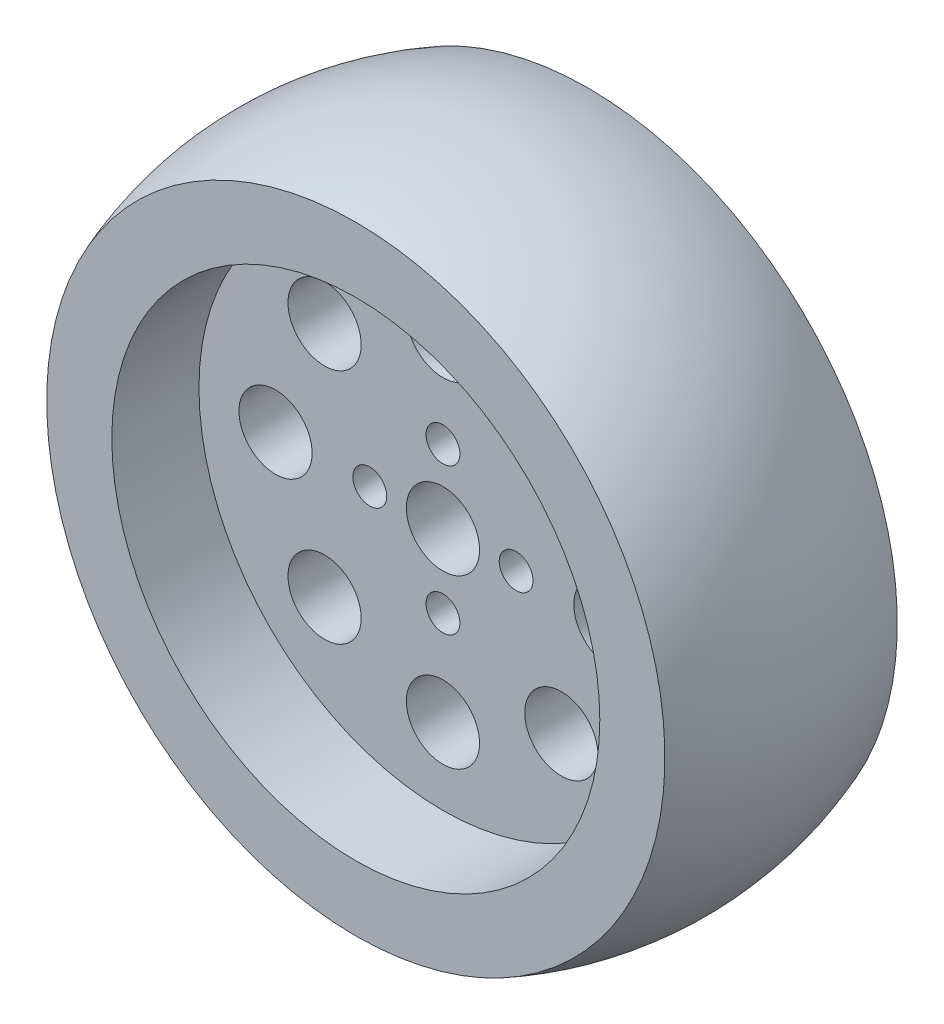
ISO-10303-21;
HEADER;
FILE_DESCRIPTION(('STEP AP214'),'2;1');
FILE_NAME('part.step','',(''),(''),'','','');
FILE_SCHEMA(('AUTOMOTIVE_DESIGN { 1 0 10303 214 1 1 1 1 }'));
ENDSEC;
DATA;
#1=APPLICATION_CONTEXT('core data for automotive mechanical design processes');
#2=APPLICATION_PROTOCOL_DEFINITION('international standard','automotive_design',2000,#1);
#3=PRODUCT_CONTEXT('',#1,'mechanical');
#4=PRODUCT('Part','Part','',(#3));
#5=PRODUCT_RELATED_PRODUCT_CATEGORY('part','',(#4));
#6=PRODUCT_DEFINITION_FORMATION('','',#4);
#7=PRODUCT_DEFINITION_CONTEXT('part definition',#1,'design');
#8=PRODUCT_DEFINITION('design','',#6,#7);
#9=PRODUCT_DEFINITION_SHAPE('','',#8);
#10=(LENGTH_UNIT() NAMED_UNIT(*) SI_UNIT(.MILLI.,.METRE.));
#11=(NAMED_UNIT(*) PLANE_ANGLE_UNIT() SI_UNIT($,.RADIAN.));
#12=(NAMED_UNIT(*) SI_UNIT($,.STERADIAN.) SOLID_ANGLE_UNIT());
#13=UNCERTAINTY_MEASURE_WITH_UNIT(LENGTH_MEASURE(1.E-05),#10,'distance_accuracy_value','');
#14=(GEOMETRIC_REPRESENTATION_CONTEXT(3) GLOBAL_UNCERTAINTY_ASSIGNED_CONTEXT((#13)) GLOBAL_UNIT_ASSIGNED_CONTEXT((#10,
#11,#12)) REPRESENTATION_CONTEXT('',''));
#15=CARTESIAN_POINT('',(0.,0.,0.));
#16=DIRECTION('',(0.,0.,1.));
#17=DIRECTION('',(1.,0.,0.));
#18=AXIS2_PLACEMENT_3D('',#15,#16,#17);
#19=CARTESIAN_POINT('',(0.,0.,-3.175));
#20=DIRECTION('',(0.,0.,1.));
#21=DIRECTION('',(0.,-1.,0.));
#22=AXIS2_PLACEMENT_3D('',#19,#20,#21);
#23=CYLINDRICAL_SURFACE('',#22,4.);
#24=CARTESIAN_POINT('',(0.,0.,3.175));
#25=DIRECTION('',(0.,0.,1.));
#26=DIRECTION('',(0.,-1.,0.));
#27=AXIS2_PLACEMENT_3D('',#24,#25,#26);
#28=CIRCLE('',#27,4.);
#29=CARTESIAN_POINT('',(0.,-4.,3.175));
#30=VERTEX_POINT('',#29);
#31=EDGE_CURVE('E77',#30,#30,#28,.F.);
#32=ORIENTED_EDGE('',*,*,#31,.F.);
#33=EDGE_LOOP('',(#32));
#34=FACE_BOUND('',#33,.T.);
#35=CARTESIAN_POINT('',(0.,0.,-3.175));
#36=DIRECTION('',(0.,0.,1.));
#37=DIRECTION('',(0.,-1.,0.));
#38=AXIS2_PLACEMENT_3D('',#35,#36,#37);
#39=CIRCLE('',#38,4.);
#40=CARTESIAN_POINT('',(0.,-4.,-3.175));
#41=VERTEX_POINT('',#40);
#42=EDGE_CURVE('E16',#41,#41,#39,.F.);
#43=ORIENTED_EDGE('',*,*,#42,.T.);
#44=EDGE_LOOP('',(#43));
#45=FACE_BOUND('',#44,.T.);
#46=ADVANCED_FACE('F13',(#34,#45),#23,.F.);
#47=CARTESIAN_POINT('',(8.,0.,-15.24));
#48=DIRECTION('',(0.,0.,1.));
#49=DIRECTION('',(1.,0.,0.));
#50=AXIS2_PLACEMENT_3D('',#47,#48,#49);
#51=CYLINDRICAL_SURFACE('',#50,1.85);
#52=CARTESIAN_POINT('',(8.,0.,3.175));
#53=DIRECTION('',(0.,0.,1.));
#54=DIRECTION('',(1.,0.,0.));
#55=AXIS2_PLACEMENT_3D('',#52,#53,#54);
#56=CIRCLE('',#55,1.85);
#57=CARTESIAN_POINT('',(9.85,0.,3.175));
#58=VERTEX_POINT('',#57);
#59=EDGE_CURVE('E74',#58,#58,#56,.F.);
#60=ORIENTED_EDGE('',*,*,#59,.F.);
#61=EDGE_LOOP('',(#60));
#62=FACE_BOUND('',#61,.T.);
#63=CARTESIAN_POINT('',(8.,0.,-3.175));
#64=DIRECTION('',(0.,0.,1.));
#65=DIRECTION('',(1.,0.,0.));
#66=AXIS2_PLACEMENT_3D('',#63,#64,#65);
#67=CIRCLE('',#66,1.85);
#68=CARTESIAN_POINT('',(9.85,0.,-3.175));
#69=VERTEX_POINT('',#68);
#70=EDGE_CURVE('E112',#69,#69,#67,.F.);
#71=ORIENTED_EDGE('',*,*,#70,.T.);
#72=EDGE_LOOP('',(#71));
#73=FACE_BOUND('',#72,.T.);
#74=ADVANCED_FACE('F335',(#62,#73),#51,.F.);
#75=CARTESIAN_POINT('',(0.,-8.,-15.24));
#76=DIRECTION('',(0.,0.,1.));
#77=DIRECTION('',(1.,0.,0.));
#78=AXIS2_PLACEMENT_3D('',#75,#76,#77);
#79=CYLINDRICAL_SURFACE('',#78,1.85);
#80=CARTESIAN_POINT('',(0.,-8.,3.175));
#81=DIRECTION('',(0.,0.,1.));
#82=DIRECTION('',(1.,0.,0.));
#83=AXIS2_PLACEMENT_3D('',#80,#81,#82);
#84=CIRCLE('',#83,1.85);
#85=CARTESIAN_POINT('',(1.85,-8.,3.175));
#86=VERTEX_POINT('',#85);
#87=EDGE_CURVE('E71',#86,#86,#84,.F.);
#88=ORIENTED_EDGE('',*,*,#87,.F.);
#89=EDGE_LOOP('',(#88));
#90=FACE_BOUND('',#89,.T.);
#91=CARTESIAN_POINT('',(0.,-8.,-3.175));
#92=DIRECTION('',(0.,0.,1.));
#93=DIRECTION('',(1.,0.,0.));
#94=AXIS2_PLACEMENT_3D('',#91,#92,#93);
#95=CIRCLE('',#94,1.85);
#96=CARTESIAN_POINT('',(1.85,-8.,-3.175));
#97=VERTEX_POINT('',#96);
#98=EDGE_CURVE('E110',#97,#97,#95,.F.);
#99=ORIENTED_EDGE('',*,*,#98,.T.);
#100=EDGE_LOOP('',(#99));
#101=FACE_BOUND('',#100,.T.);
#102=ADVANCED_FACE('F324',(#90,#101),#79,.F.);
#103=CARTESIAN_POINT('',(-8.,0.,-15.24));
#104=DIRECTION('',(0.,0.,1.));
#105=DIRECTION('',(1.,0.,0.));
#106=AXIS2_PLACEMENT_3D('',#103,#104,#105);
#107=CYLINDRICAL_SURFACE('',#106,1.85);
#108=CARTESIAN_POINT('',(-8.,0.,3.175));
#109=DIRECTION('',(0.,0.,1.));
#110=DIRECTION('',(1.,0.,0.));
#111=AXIS2_PLACEMENT_3D('',#108,#109,#110);
#112=CIRCLE('',#111,1.85);
#113=CARTESIAN_POINT('',(-6.15,0.,3.175));
#114=VERTEX_POINT('',#113);
#115=EDGE_CURVE('E68',#114,#114,#112,.F.);
#116=ORIENTED_EDGE('',*,*,#115,.F.);
#117=EDGE_LOOP('',(#116));
#118=FACE_BOUND('',#117,.T.);
#119=CARTESIAN_POINT('',(-8.,0.,-3.175));
#120=DIRECTION('',(0.,0.,1.));
#121=DIRECTION('',(1.,0.,0.));
#122=AXIS2_PLACEMENT_3D('',#119,#120,#121);
#123=CIRCLE('',#122,1.85);
#124=CARTESIAN_POINT('',(-6.15,0.,-3.175));
#125=VERTEX_POINT('',#124);
#126=EDGE_CURVE('E107',#125,#125,#123,.F.);
#127=ORIENTED_EDGE('',*,*,#126,.T.);
#128=EDGE_LOOP('',(#127));
#129=FACE_BOUND('',#128,.T.);
#130=ADVANCED_FACE('F313',(#118,#129),#107,.F.);
#131=CARTESIAN_POINT('',(0.,8.,-15.24));
#132=DIRECTION('',(0.,0.,1.));
#133=DIRECTION('',(1.,0.,0.));
#134=AXIS2_PLACEMENT_3D('',#131,#132,#133);
#135=CYLINDRICAL_SURFACE('',#134,1.85);
#136=CARTESIAN_POINT('',(0.,8.,3.175));
#137=DIRECTION('',(0.,0.,1.));
#138=DIRECTION('',(1.,0.,0.));
#139=AXIS2_PLACEMENT_3D('',#136,#137,#138);
#140=CIRCLE('',#139,1.85);
#141=CARTESIAN_POINT('',(1.85,8.,3.175));
#142=VERTEX_POINT('',#141);
#143=EDGE_CURVE('E65',#142,#142,#140,.F.);
#144=ORIENTED_EDGE('',*,*,#143,.F.);
#145=EDGE_LOOP('',(#144));
#146=FACE_BOUND('',#145,.T.);
#147=CARTESIAN_POINT('',(0.,8.,-3.175));
#148=DIRECTION('',(0.,0.,1.));
#149=DIRECTION('',(1.,0.,0.));
#150=AXIS2_PLACEMENT_3D('',#147,#148,#149);
#151=CIRCLE('',#150,1.85);
#152=CARTESIAN_POINT('',(1.85,8.,-3.175));
#153=VERTEX_POINT('',#152);
#154=EDGE_CURVE('E104',#153,#153,#151,.F.);
#155=ORIENTED_EDGE('',*,*,#154,.T.);
#156=EDGE_LOOP('',(#155));
#157=FACE_BOUND('',#156,.T.);
#158=ADVANCED_FACE('F302',(#146,#157),#135,.F.);
#159=CARTESIAN_POINT('',(0.,-18.3,3.175));
#160=DIRECTION('',(0.,0.,-1.));
#161=DIRECTION('',(0.,1.,0.));
#162=AXIS2_PLACEMENT_3D('',#159,#160,#161);
#163=CYLINDRICAL_SURFACE('',#162,4.);
#164=CARTESIAN_POINT('',(0.,-18.3,3.175));
#165=DIRECTION('',(0.,0.,-1.));
#166=DIRECTION('',(0.,1.,0.));
#167=AXIS2_PLACEMENT_3D('',#164,#165,#166);
#168=CIRCLE('',#167,4.);
#169=CARTESIAN_POINT('',(0.,-14.3,3.175));
#170=VERTEX_POINT('',#169);
#171=EDGE_CURVE('E62',#170,#170,#168,.T.);
#172=ORIENTED_EDGE('',*,*,#171,.F.);
#173=EDGE_LOOP('',(#172));
#174=FACE_BOUND('',#173,.T.);
#175=CARTESIAN_POINT('',(0.,-18.3,-3.175));
#176=DIRECTION('',(0.,0.,-1.));
#177=DIRECTION('',(0.,1.,0.));
#178=AXIS2_PLACEMENT_3D('',#175,#176,#177);
#179=CIRCLE('',#178,4.);
#180=CARTESIAN_POINT('',(0.,-14.3,-3.175));
#181=VERTEX_POINT('',#180);
#182=EDGE_CURVE('E101',#181,#181,#179,.T.);
#183=ORIENTED_EDGE('',*,*,#182,.T.);
#184=EDGE_LOOP('',(#183));
#185=FACE_BOUND('',#184,.T.);
#186=ADVANCED_FACE('F291',(#174,#185),#163,.F.);
#187=CARTESIAN_POINT('',(12.9400540957138,-12.9400540957138,3.175));
#188=DIRECTION('',(0.,0.,-1.));
#189=DIRECTION('',(0.,1.,0.));
#190=AXIS2_PLACEMENT_3D('',#187,#188,#189);
#191=CYLINDRICAL_SURFACE('',#190,4.);
#192=CARTESIAN_POINT('',(12.9400540957138,-12.9400540957138,3.175));
#193=DIRECTION('',(0.,0.,-1.));
#194=DIRECTION('',(0.,1.,0.));
#195=AXIS2_PLACEMENT_3D('',#192,#193,#194);
#196=CIRCLE('',#195,4.);
#197=CARTESIAN_POINT('',(12.9400540957138,-8.94005409571382,3.175));
#198=VERTEX_POINT('',#197);
#199=EDGE_CURVE('E59',#198,#198,#196,.T.);
#200=ORIENTED_EDGE('',*,*,#199,.F.);
#201=EDGE_LOOP('',(#200));
#202=FACE_BOUND('',#201,.T.);
#203=CARTESIAN_POINT('',(12.9400540957138,-12.9400540957138,-3.175));
#204=DIRECTION('',(0.,0.,-1.));
#205=DIRECTION('',(0.,1.,0.));
#206=AXIS2_PLACEMENT_3D('',#203,#204,#205);
#207=CIRCLE('',#206,4.);
#208=CARTESIAN_POINT('',(12.9400540957138,-8.94005409571382,-3.175));
#209=VERTEX_POINT('',#208);
#210=EDGE_CURVE('E98',#209,#209,#207,.T.);
#211=ORIENTED_EDGE('',*,*,#210,.T.);
#212=EDGE_LOOP('',(#211));
#213=FACE_BOUND('',#212,.T.);
#214=ADVANCED_FACE('F280',(#202,#213),#191,.F.);
#215=CARTESIAN_POINT('',(18.3,0.,3.175));
#216=DIRECTION('',(0.,0.,-1.));
#217=DIRECTION('',(0.,1.,0.));
#218=AXIS2_PLACEMENT_3D('',#215,#216,#217);
#219=CYLINDRICAL_SURFACE('',#218,4.);
#220=CARTESIAN_POINT('',(18.3,0.,3.175));
#221=DIRECTION('',(0.,0.,-1.));
#222=DIRECTION('',(0.,1.,0.));
#223=AXIS2_PLACEMENT_3D('',#220,#221,#222);
#224=CIRCLE('',#223,4.);
#225=CARTESIAN_POINT('',(18.3,4.,3.175));
#226=VERTEX_POINT('',#225);
#227=EDGE_CURVE('E56',#226,#226,#224,.T.);
#228=ORIENTED_EDGE('',*,*,#227,.F.);
#229=EDGE_LOOP('',(#228));
#230=FACE_BOUND('',#229,.T.);
#231=CARTESIAN_POINT('',(18.3,0.,-3.175));
#232=DIRECTION('',(0.,0.,-1.));
#233=DIRECTION('',(0.,1.,0.));
#234=AXIS2_PLACEMENT_3D('',#231,#232,#233);
#235=CIRCLE('',#234,4.);
#236=CARTESIAN_POINT('',(18.3,4.,-3.175));
#237=VERTEX_POINT('',#236);
#238=EDGE_CURVE('E95',#237,#237,#235,.T.);
#239=ORIENTED_EDGE('',*,*,#238,.T.);
#240=EDGE_LOOP('',(#239));
#241=FACE_BOUND('',#240,.T.);
#242=ADVANCED_FACE('F269',(#230,#241),#219,.F.);
#243=CARTESIAN_POINT('',(12.9400540957138,12.9400540957138,3.175));
#244=DIRECTION('',(0.,0.,-1.));
#245=DIRECTION('',(0.,1.,0.));
#246=AXIS2_PLACEMENT_3D('',#243,#244,#245);
#247=CYLINDRICAL_SURFACE('',#246,4.);
#248=CARTESIAN_POINT('',(12.9400540957138,12.9400540957138,3.175));
#249=DIRECTION('',(0.,0.,-1.));
#250=DIRECTION('',(0.,1.,0.));
#251=AXIS2_PLACEMENT_3D('',#248,#249,#250);
#252=CIRCLE('',#251,4.);
#253=CARTESIAN_POINT('',(12.9400540957138,16.9400540957138,3.175));
#254=VERTEX_POINT('',#253);
#255=EDGE_CURVE('E53',#254,#254,#252,.T.);
#256=ORIENTED_EDGE('',*,*,#255,.F.);
#257=EDGE_LOOP('',(#256));
#258=FACE_BOUND('',#257,.T.);
#259=CARTESIAN_POINT('',(12.9400540957138,12.9400540957138,-3.175));
#260=DIRECTION('',(0.,0.,-1.));
#261=DIRECTION('',(0.,1.,0.));
#262=AXIS2_PLACEMENT_3D('',#259,#260,#261);
#263=CIRCLE('',#262,4.);
#264=CARTESIAN_POINT('',(12.9400540957138,16.9400540957138,-3.175));
#265=VERTEX_POINT('',#264);
#266=EDGE_CURVE('E92',#265,#265,#263,.T.);
#267=ORIENTED_EDGE('',*,*,#266,.T.);
#268=EDGE_LOOP('',(#267));
#269=FACE_BOUND('',#268,.T.);
#270=ADVANCED_FACE('F258',(#258,#269),#247,.F.);
#271=CARTESIAN_POINT('',(0.,18.3,3.175));
#272=DIRECTION('',(0.,0.,-1.));
#273=DIRECTION('',(0.,1.,0.));
#274=AXIS2_PLACEMENT_3D('',#271,#272,#273);
#275=CYLINDRICAL_SURFACE('',#274,4.);
#276=CARTESIAN_POINT('',(0.,18.3,3.175));
#277=DIRECTION('',(0.,0.,-1.));
#278=DIRECTION('',(0.,1.,0.));
#279=AXIS2_PLACEMENT_3D('',#276,#277,#278);
#280=CIRCLE('',#279,4.);
#281=CARTESIAN_POINT('',(0.,22.3,3.175));
#282=VERTEX_POINT('',#281);
#283=EDGE_CURVE('E50',#282,#282,#280,.T.);
#284=ORIENTED_EDGE('',*,*,#283,.F.);
#285=EDGE_LOOP('',(#284));
#286=FACE_BOUND('',#285,.T.);
#287=CARTESIAN_POINT('',(0.,18.3,-3.175));
#288=DIRECTION('',(0.,0.,-1.));
#289=DIRECTION('',(0.,1.,0.));
#290=AXIS2_PLACEMENT_3D('',#287,#288,#289);
#291=CIRCLE('',#290,4.);
#292=CARTESIAN_POINT('',(0.,22.3,-3.175));
#293=VERTEX_POINT('',#292);
#294=EDGE_CURVE('E89',#293,#293,#291,.T.);
#295=ORIENTED_EDGE('',*,*,#294,.T.);
#296=EDGE_LOOP('',(#295));
#297=FACE_BOUND('',#296,.T.);
#298=ADVANCED_FACE('F247',(#286,#297),#275,.F.);
#299=CARTESIAN_POINT('',(-12.9400540957138,12.9400540957138,3.175));
#300=DIRECTION('',(0.,0.,-1.));
#301=DIRECTION('',(0.,1.,0.));
#302=AXIS2_PLACEMENT_3D('',#299,#300,#301);
#303=CYLINDRICAL_SURFACE('',#302,4.);
#304=CARTESIAN_POINT('',(-12.9400540957138,12.9400540957138,3.175));
#305=DIRECTION('',(0.,0.,-1.));
#306=DIRECTION('',(0.,1.,0.));
#307=AXIS2_PLACEMENT_3D('',#304,#305,#306);
#308=CIRCLE('',#307,4.);
#309=CARTESIAN_POINT('',(-12.9400540957138,16.9400540957138,3.175));
#310=VERTEX_POINT('',#309);
#311=EDGE_CURVE('E47',#310,#310,#308,.T.);
#312=ORIENTED_EDGE('',*,*,#311,.F.);
#313=EDGE_LOOP('',(#312));
#314=FACE_BOUND('',#313,.T.);
#315=CARTESIAN_POINT('',(-12.9400540957138,12.9400540957138,-3.175));
#316=DIRECTION('',(0.,0.,-1.));
#317=DIRECTION('',(0.,1.,0.));
#318=AXIS2_PLACEMENT_3D('',#315,#316,#317);
#319=CIRCLE('',#318,4.);
#320=CARTESIAN_POINT('',(-12.9400540957138,16.9400540957138,-3.175));
#321=VERTEX_POINT('',#320);
#322=EDGE_CURVE('E86',#321,#321,#319,.T.);
#323=ORIENTED_EDGE('',*,*,#322,.T.);
#324=EDGE_LOOP('',(#323));
#325=FACE_BOUND('',#324,.T.);
#326=ADVANCED_FACE('F236',(#314,#325),#303,.F.);
#327=CARTESIAN_POINT('',(-18.3,0.,3.175));
#328=DIRECTION('',(0.,0.,-1.));
#329=DIRECTION('',(0.,1.,0.));
#330=AXIS2_PLACEMENT_3D('',#327,#328,#329);
#331=CYLINDRICAL_SURFACE('',#330,4.);
#332=CARTESIAN_POINT('',(-18.3,0.,3.175));
#333=DIRECTION('',(0.,0.,-1.));
#334=DIRECTION('',(0.,1.,0.));
#335=AXIS2_PLACEMENT_3D('',#332,#333,#334);
#336=CIRCLE('',#335,4.);
#337=CARTESIAN_POINT('',(-18.3,4.00000000000001,3.175));
#338=VERTEX_POINT('',#337);
#339=EDGE_CURVE('E44',#338,#338,#336,.T.);
#340=ORIENTED_EDGE('',*,*,#339,.F.);
#341=EDGE_LOOP('',(#340));
#342=FACE_BOUND('',#341,.T.);
#343=CARTESIAN_POINT('',(-18.3,0.,-3.175));
#344=DIRECTION('',(0.,0.,-1.));
#345=DIRECTION('',(0.,1.,0.));
#346=AXIS2_PLACEMENT_3D('',#343,#344,#345);
#347=CIRCLE('',#346,4.);
#348=CARTESIAN_POINT('',(-18.3,4.00000000000001,-3.175));
#349=VERTEX_POINT('',#348);
#350=EDGE_CURVE('E83',#349,#349,#347,.T.);
#351=ORIENTED_EDGE('',*,*,#350,.T.);
#352=EDGE_LOOP('',(#351));
#353=FACE_BOUND('',#352,.T.);
#354=ADVANCED_FACE('F226',(#342,#353),#331,.F.);
#355=CARTESIAN_POINT('',(-12.9400540957138,-12.9400540957138,3.175));
#356=DIRECTION('',(0.,0.,-1.));
#357=DIRECTION('',(0.,1.,0.));
#358=AXIS2_PLACEMENT_3D('',#355,#356,#357);
#359=CYLINDRICAL_SURFACE('',#358,4.);
#360=CARTESIAN_POINT('',(-12.9400540957138,-12.9400540957138,3.175));
#361=DIRECTION('',(0.,0.,-1.));
#362=DIRECTION('',(0.,1.,0.));
#363=AXIS2_PLACEMENT_3D('',#360,#361,#362);
#364=CIRCLE('',#363,4.);
#365=CARTESIAN_POINT('',(-12.9400540957138,-8.94005409571381,3.175));
#366=VERTEX_POINT('',#365);
#367=EDGE_CURVE('E41',#366,#366,#364,.T.);
#368=ORIENTED_EDGE('',*,*,#367,.F.);
#369=EDGE_LOOP('',(#368));
#370=FACE_BOUND('',#369,.T.);
#371=CARTESIAN_POINT('',(-12.9400540957138,-12.9400540957138,-3.175));
#372=DIRECTION('',(0.,0.,-1.));
#373=DIRECTION('',(0.,1.,0.));
#374=AXIS2_PLACEMENT_3D('',#371,#372,#373);
#375=CIRCLE('',#374,4.);
#376=CARTESIAN_POINT('',(-12.9400540957138,-8.94005409571382,-3.175));
#377=VERTEX_POINT('',#376);
#378=EDGE_CURVE('E80',#377,#377,#375,.T.);
#379=ORIENTED_EDGE('',*,*,#378,.T.);
#380=EDGE_LOOP('',(#379));
#381=FACE_BOUND('',#380,.T.);
#382=ADVANCED_FACE('F124',(#370,#381),#359,.F.);
#383=CARTESIAN_POINT('',(0.,0.,-3.175));
#384=DIRECTION('',(0.,0.,1.));
#385=DIRECTION('',(0.,-1.,0.));
#386=AXIS2_PLACEMENT_3D('',#383,#384,#385);
#387=PLANE('',#386);
#388=ORIENTED_EDGE('',*,*,#378,.F.);
#389=EDGE_LOOP('',(#388));
#390=FACE_BOUND('',#389,.T.);
#391=ORIENTED_EDGE('',*,*,#350,.F.);
#392=EDGE_LOOP('',(#391));
#393=FACE_BOUND('',#392,.T.);
#394=ORIENTED_EDGE('',*,*,#322,.F.);
#395=EDGE_LOOP('',(#394));
#396=FACE_BOUND('',#395,.T.);
#397=ORIENTED_EDGE('',*,*,#294,.F.);
#398=EDGE_LOOP('',(#397));
#399=FACE_BOUND('',#398,.T.);
#400=ORIENTED_EDGE('',*,*,#266,.F.);
#401=EDGE_LOOP('',(#400));
#402=FACE_BOUND('',#401,.T.);
#403=ORIENTED_EDGE('',*,*,#238,.F.);
#404=EDGE_LOOP('',(#403));
#405=FACE_BOUND('',#404,.T.);
#406=ORIENTED_EDGE('',*,*,#210,.F.);
#407=EDGE_LOOP('',(#406));
#408=FACE_BOUND('',#407,.T.);
#409=ORIENTED_EDGE('',*,*,#182,.F.);
#410=EDGE_LOOP('',(#409));
#411=FACE_BOUND('',#410,.T.);
#412=ORIENTED_EDGE('',*,*,#154,.F.);
#413=EDGE_LOOP('',(#412));
#414=FACE_BOUND('',#413,.T.);
#415=ORIENTED_EDGE('',*,*,#126,.F.);
#416=EDGE_LOOP('',(#415));
#417=FACE_BOUND('',#416,.T.);
#418=ORIENTED_EDGE('',*,*,#98,.F.);
#419=EDGE_LOOP('',(#418));
#420=FACE_BOUND('',#419,.T.);
#421=ORIENTED_EDGE('',*,*,#70,.F.);
#422=EDGE_LOOP('',(#421));
#423=FACE_BOUND('',#422,.T.);
#424=ORIENTED_EDGE('',*,*,#42,.F.);
#425=EDGE_LOOP('',(#424));
#426=FACE_BOUND('',#425,.T.);
#427=CARTESIAN_POINT('',(0.,0.,-3.175));
#428=DIRECTION('',(0.,0.,1.));
#429=DIRECTION('',(0.,-1.,0.));
#430=AXIS2_PLACEMENT_3D('',#427,#428,#429);
#431=CIRCLE('',#430,26.67);
#432=CARTESIAN_POINT('',(0.,-26.67,-3.175));
#433=VERTEX_POINT('',#432);
#434=EDGE_CURVE('E38',#433,#433,#431,.F.);
#435=ORIENTED_EDGE('',*,*,#434,.T.);
#436=EDGE_LOOP('',(#435));
#437=FACE_BOUND('',#436,.T.);
#438=ADVANCED_FACE('F120',(#390,#393,#396,#399,#402,#405,#408,#411,#414,#417,#420,#423,#426,
#437),#387,.F.);
#439=CARTESIAN_POINT('',(0.,0.,3.175));
#440=DIRECTION('',(0.,0.,1.));
#441=DIRECTION('',(0.,-1.,0.));
#442=AXIS2_PLACEMENT_3D('',#439,#440,#441);
#443=PLANE('',#442);
#444=ORIENTED_EDGE('',*,*,#367,.T.);
#445=EDGE_LOOP('',(#444));
#446=FACE_BOUND('',#445,.T.);
#447=ORIENTED_EDGE('',*,*,#339,.T.);
#448=EDGE_LOOP('',(#447));
#449=FACE_BOUND('',#448,.T.);
#450=ORIENTED_EDGE('',*,*,#311,.T.);
#451=EDGE_LOOP('',(#450));
#452=FACE_BOUND('',#451,.T.);
#453=ORIENTED_EDGE('',*,*,#283,.T.);
#454=EDGE_LOOP('',(#453));
#455=FACE_BOUND('',#454,.T.);
#456=ORIENTED_EDGE('',*,*,#255,.T.);
#457=EDGE_LOOP('',(#456));
#458=FACE_BOUND('',#457,.T.);
#459=ORIENTED_EDGE('',*,*,#227,.T.);
#460=EDGE_LOOP('',(#459));
#461=FACE_BOUND('',#460,.T.);
#462=ORIENTED_EDGE('',*,*,#199,.T.);
#463=EDGE_LOOP('',(#462));
#464=FACE_BOUND('',#463,.T.);
#465=ORIENTED_EDGE('',*,*,#171,.T.);
#466=EDGE_LOOP('',(#465));
#467=FACE_BOUND('',#466,.T.);
#468=ORIENTED_EDGE('',*,*,#143,.T.);
#469=EDGE_LOOP('',(#468));
#470=FACE_BOUND('',#469,.T.);
#471=ORIENTED_EDGE('',*,*,#115,.T.);
#472=EDGE_LOOP('',(#471));
#473=FACE_BOUND('',#472,.T.);
#474=ORIENTED_EDGE('',*,*,#87,.T.);
#475=EDGE_LOOP('',(#474));
#476=FACE_BOUND('',#475,.T.);
#477=ORIENTED_EDGE('',*,*,#59,.T.);
#478=EDGE_LOOP('',(#477));
#479=FACE_BOUND('',#478,.T.);
#480=ORIENTED_EDGE('',*,*,#31,.T.);
#481=EDGE_LOOP('',(#480));
#482=FACE_BOUND('',#481,.T.);
#483=CARTESIAN_POINT('',(0.,0.,3.17499999999999));
#484=DIRECTION('',(0.,0.,1.));
#485=DIRECTION('',(0.,-1.,0.));
#486=AXIS2_PLACEMENT_3D('',#483,#484,#485);
#487=CIRCLE('',#486,26.67);
#488=CARTESIAN_POINT('',(0.,-26.67,3.175));
#489=VERTEX_POINT('',#488);
#490=EDGE_CURVE('E35',#489,#489,#487,.T.);
#491=ORIENTED_EDGE('',*,*,#490,.T.);
#492=EDGE_LOOP('',(#491));
#493=FACE_BOUND('',#492,.T.);
#494=ADVANCED_FACE('F123',(#446,#449,#452,#455,#458,#461,#464,#467,#470,#473,#476,#479,#482,
#493),#443,.T.);
#495=CARTESIAN_POINT('',(0.,0.,-13.97));
#496=DIRECTION('',(0.,0.,1.));
#497=DIRECTION('',(0.,-1.,0.));
#498=AXIS2_PLACEMENT_3D('',#495,#496,#497);
#499=CYLINDRICAL_SURFACE('',#498,26.67);
#500=CARTESIAN_POINT('',(0.,0.,-12.7));
#501=DIRECTION('',(0.,0.,1.));
#502=DIRECTION('',(0.,-1.,0.));
#503=AXIS2_PLACEMENT_3D('',#500,#501,#502);
#504=CIRCLE('',#503,26.67);
#505=CARTESIAN_POINT('',(0.,-26.67,-12.7));
#506=VERTEX_POINT('',#505);
#507=EDGE_CURVE('E32',#506,#506,#504,.F.);
#508=ORIENTED_EDGE('',*,*,#507,.T.);
#509=EDGE_LOOP('',(#508));
#510=FACE_BOUND('',#509,.T.);
#511=ORIENTED_EDGE('',*,*,#434,.F.);
#512=EDGE_LOOP('',(#511));
#513=FACE_BOUND('',#512,.T.);
#514=ADVANCED_FACE('F129',(#510,#513),#499,.F.);
#515=CARTESIAN_POINT('',(0.,0.,-13.97));
#516=DIRECTION('',(0.,0.,1.));
#517=DIRECTION('',(0.,-1.,0.));
#518=AXIS2_PLACEMENT_3D('',#515,#516,#517);
#519=CYLINDRICAL_SURFACE('',#518,26.67);
#520=ORIENTED_EDGE('',*,*,#490,.F.);
#521=EDGE_LOOP('',(#520));
#522=FACE_BOUND('',#521,.T.);
#523=CARTESIAN_POINT('',(0.,0.,12.7));
#524=DIRECTION('',(0.,0.,1.));
#525=DIRECTION('',(0.,-1.,0.));
#526=AXIS2_PLACEMENT_3D('',#523,#524,#525);
#527=CIRCLE('',#526,26.67);
#528=CARTESIAN_POINT('',(0.,-26.67,12.7));
#529=VERTEX_POINT('',#528);
#530=EDGE_CURVE('E25',#529,#529,#527,.F.);
#531=ORIENTED_EDGE('',*,*,#530,.F.);
#532=EDGE_LOOP('',(#531));
#533=FACE_BOUND('',#532,.T.);
#534=ADVANCED_FACE('F131',(#522,#533),#519,.F.);
#535=CARTESIAN_POINT('',(0.,0.,-12.7));
#536=DIRECTION('',(0.,0.,1.));
#537=DIRECTION('',(0.,-1.,0.));
#538=AXIS2_PLACEMENT_3D('',#535,#536,#537);
#539=PLANE('',#538);
#540=ORIENTED_EDGE('',*,*,#507,.F.);
#541=EDGE_LOOP('',(#540));
#542=FACE_BOUND('',#541,.T.);
#543=CARTESIAN_POINT('',(0.,0.,-12.7));
#544=DIRECTION('',(0.,0.,1.));
#545=DIRECTION('',(0.,-1.,0.));
#546=AXIS2_PLACEMENT_3D('',#543,#544,#545);
#547=CIRCLE('',#546,33.7854568026025);
#548=CARTESIAN_POINT('',(0.,-33.7854568026025,-12.7));
#549=VERTEX_POINT('',#548);
#550=EDGE_CURVE('E20',#549,#549,#547,.T.);
#551=ORIENTED_EDGE('',*,*,#550,.F.);
#552=EDGE_LOOP('',(#551));
#553=FACE_BOUND('',#552,.T.);
#554=ADVANCED_FACE('F139',(#542,#553),#539,.F.);
#555=CARTESIAN_POINT('',(0.,0.,12.7));
#556=DIRECTION('',(0.,0.,1.));
#557=DIRECTION('',(0.,-1.,0.));
#558=AXIS2_PLACEMENT_3D('',#555,#556,#557);
#559=PLANE('',#558);
#560=ORIENTED_EDGE('',*,*,#530,.T.);
#561=EDGE_LOOP('',(#560));
#562=FACE_BOUND('',#561,.T.);
#563=CARTESIAN_POINT('',(0.,0.,12.7));
#564=DIRECTION('',(0.,0.,1.));
#565=DIRECTION('',(0.,-1.,0.));
#566=AXIS2_PLACEMENT_3D('',#563,#564,#565);
#567=CIRCLE('',#566,33.7854568026025);
#568=CARTESIAN_POINT('',(0.,-33.7854568026025,12.7));
#569=VERTEX_POINT('',#568);
#570=EDGE_CURVE('E9',#569,#569,#567,.F.);
#571=ORIENTED_EDGE('',*,*,#570,.F.);
#572=EDGE_LOOP('',(#571));
#573=FACE_BOUND('',#572,.T.);
#574=ADVANCED_FACE('F146',(#562,#573),#559,.T.);
#575=CARTESIAN_POINT('',(0.,0.100000000000006,0.));
#576=DIRECTION('',(-1.,0.,0.));
#577=DIRECTION('',(0.,1.,0.));
#578=AXIS2_PLACEMENT_3D('',#575,#576,#577);
#579=CIRCLE('',#578,36.);
#580=TRIMMED_CURVE('',#579,(PARAMETER_VALUE(-1.57357410814493)),
(PARAMETER_VALUE(1.57357410814493)),.T.,.PARAMETER.);
#581=CARTESIAN_POINT('',(0.,0.,0.));
#582=DIRECTION('',(0.,0.,1.));
#583=AXIS1_PLACEMENT('',#581,#582);
#584=SURFACE_OF_REVOLUTION('',#580,#583);
#585=ORIENTED_EDGE('',*,*,#570,.T.);
#586=EDGE_LOOP('',(#585));
#587=FACE_BOUND('',#586,.T.);
#588=ORIENTED_EDGE('',*,*,#550,.T.);
#589=EDGE_LOOP('',(#588));
#590=FACE_BOUND('',#589,.T.);
#591=ADVANCED_FACE('F144',(#587,#590),#584,.F.);
#592=CLOSED_SHELL('',(#46,#74,#102,#130,#158,#186,#214,#242,#270,#298,#326,#354,#382,#438,#494,
#514,#534,#554,#574,#591));
#593=MANIFOLD_SOLID_BREP('B1',#592);
#594=ADVANCED_BREP_SHAPE_REPRESENTATION('',(#18,#593),#14);
#595=SHAPE_DEFINITION_REPRESENTATION(#9,#594);
ENDSEC;
END-ISO-10303-21;
